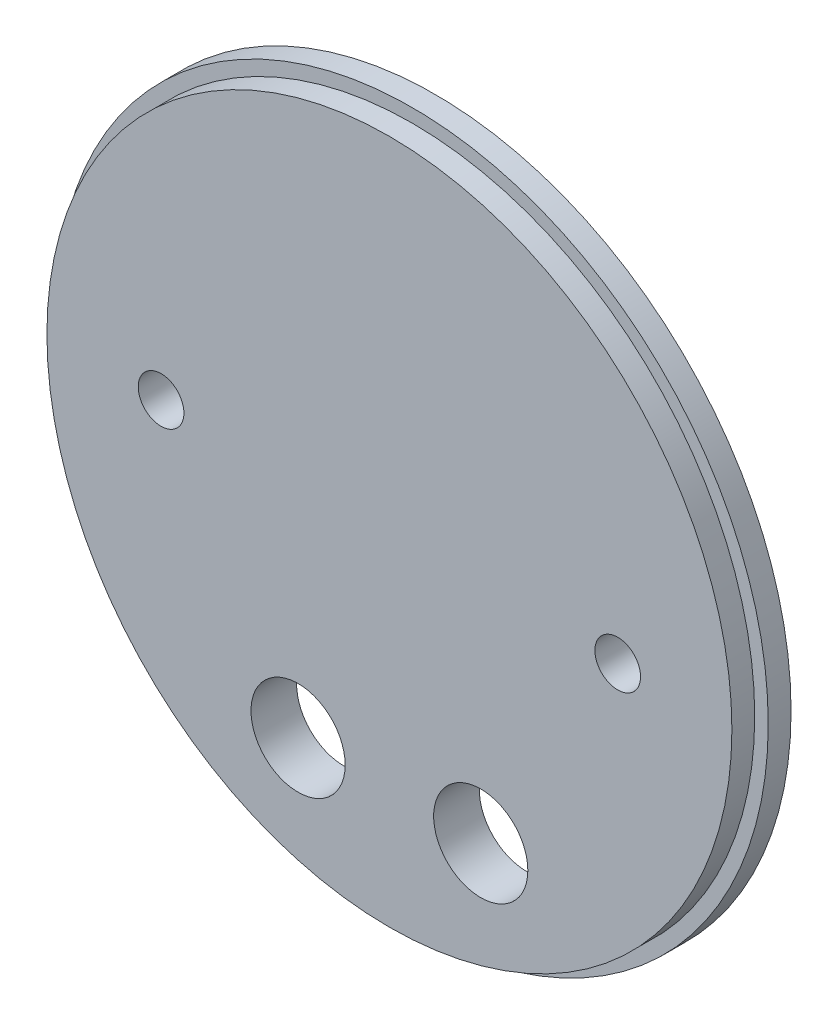
ISO-10303-21;
HEADER;
FILE_DESCRIPTION(('STEP AP214'),'2;1');
FILE_NAME('part.step','',(''),(''),'','','');
FILE_SCHEMA(('AUTOMOTIVE_DESIGN { 1 0 10303 214 1 1 1 1 }'));
ENDSEC;
DATA;
#1=APPLICATION_CONTEXT('core data for automotive mechanical design processes');
#2=APPLICATION_PROTOCOL_DEFINITION('international standard','automotive_design',2000,#1);
#3=PRODUCT_CONTEXT('',#1,'mechanical');
#4=PRODUCT('Part','Part','',(#3));
#5=PRODUCT_RELATED_PRODUCT_CATEGORY('part','',(#4));
#6=PRODUCT_DEFINITION_FORMATION('','',#4);
#7=PRODUCT_DEFINITION_CONTEXT('part definition',#1,'design');
#8=PRODUCT_DEFINITION('design','',#6,#7);
#9=PRODUCT_DEFINITION_SHAPE('','',#8);
#10=(LENGTH_UNIT() NAMED_UNIT(*) SI_UNIT(.MILLI.,.METRE.));
#11=(NAMED_UNIT(*) PLANE_ANGLE_UNIT() SI_UNIT($,.RADIAN.));
#12=(NAMED_UNIT(*) SI_UNIT($,.STERADIAN.) SOLID_ANGLE_UNIT());
#13=UNCERTAINTY_MEASURE_WITH_UNIT(LENGTH_MEASURE(1.E-05),#10,'distance_accuracy_value','');
#14=(GEOMETRIC_REPRESENTATION_CONTEXT(3) GLOBAL_UNCERTAINTY_ASSIGNED_CONTEXT((#13)) GLOBAL_UNIT_ASSIGNED_CONTEXT((#10,
#11,#12)) REPRESENTATION_CONTEXT('',''));
#15=CARTESIAN_POINT('',(0.,0.,0.));
#16=DIRECTION('',(0.,0.,1.));
#17=DIRECTION('',(1.,0.,0.));
#18=AXIS2_PLACEMENT_3D('',#15,#16,#17);
#19=CARTESIAN_POINT('',(0.,0.,3.175));
#20=DIRECTION('',(0.,0.,-1.));
#21=DIRECTION('',(-1.,0.,0.));
#22=AXIS2_PLACEMENT_3D('',#19,#20,#21);
#23=CYLINDRICAL_SURFACE('',#22,49.5046);
#24=CARTESIAN_POINT('',(0.,0.,3.175));
#25=DIRECTION('',(0.,0.,1.));
#26=DIRECTION('',(1.,0.,0.));
#27=AXIS2_PLACEMENT_3D('',#24,#25,#26);
#28=CIRCLE('',#27,49.5046);
#29=CARTESIAN_POINT('',(49.5046,0.,3.175));
#30=VERTEX_POINT('',#29);
#31=EDGE_CURVE('E39',#30,#30,#28,.T.);
#32=ORIENTED_EDGE('',*,*,#31,.F.);
#33=EDGE_LOOP('',(#32));
#34=FACE_BOUND('',#33,.T.);
#35=CARTESIAN_POINT('',(0.,0.,0.));
#36=DIRECTION('',(0.,0.,1.));
#37=DIRECTION('',(1.,0.,0.));
#38=AXIS2_PLACEMENT_3D('',#35,#36,#37);
#39=CIRCLE('',#38,49.5046);
#40=CARTESIAN_POINT('',(49.5046,0.,0.));
#41=VERTEX_POINT('',#40);
#42=EDGE_CURVE('E35',#41,#41,#39,.T.);
#43=ORIENTED_EDGE('',*,*,#42,.T.);
#44=EDGE_LOOP('',(#43));
#45=FACE_BOUND('',#44,.T.);
#46=ADVANCED_FACE('F32',(#34,#45),#23,.T.);
#47=CARTESIAN_POINT('',(0.,0.,3.175));
#48=DIRECTION('',(0.,0.,1.));
#49=DIRECTION('',(1.,0.,0.));
#50=AXIS2_PLACEMENT_3D('',#47,#48,#49);
#51=PLANE('',#50);
#52=CARTESIAN_POINT('',(0.,0.,3.175));
#53=DIRECTION('',(0.,0.,1.));
#54=DIRECTION('',(1.,0.,0.));
#55=AXIS2_PLACEMENT_3D('',#52,#53,#54);
#56=CIRCLE('',#55,47.625);
#57=CARTESIAN_POINT('',(47.625,0.,3.175));
#58=VERTEX_POINT('',#57);
#59=EDGE_CURVE('E10',#58,#58,#56,.T.);
#60=ORIENTED_EDGE('',*,*,#59,.F.);
#61=EDGE_LOOP('',(#60));
#62=FACE_BOUND('',#61,.T.);
#63=ORIENTED_EDGE('',*,*,#31,.T.);
#64=EDGE_LOOP('',(#63));
#65=FACE_BOUND('',#64,.T.);
#66=ADVANCED_FACE('F99',(#62,#65),#51,.T.);
#67=CARTESIAN_POINT('',(0.,0.,0.));
#68=DIRECTION('',(0.,0.,1.));
#69=DIRECTION('',(1.,0.,0.));
#70=AXIS2_PLACEMENT_3D('',#67,#68,#69);
#71=PLANE('',#70);
#72=CARTESIAN_POINT('',(31.75,0.,0.));
#73=DIRECTION('',(0.,0.,1.));
#74=DIRECTION('',(1.,0.,0.));
#75=AXIS2_PLACEMENT_3D('',#72,#73,#74);
#76=CIRCLE('',#75,3.175);
#77=CARTESIAN_POINT('',(34.925,0.,0.));
#78=VERTEX_POINT('',#77);
#79=EDGE_CURVE('E58',#78,#78,#76,.T.);
#80=ORIENTED_EDGE('',*,*,#79,.T.);
#81=EDGE_LOOP('',(#80));
#82=FACE_BOUND('',#81,.T.);
#83=CARTESIAN_POINT('',(-31.75,0.,0.));
#84=DIRECTION('',(0.,0.,1.));
#85=DIRECTION('',(1.,0.,0.));
#86=AXIS2_PLACEMENT_3D('',#83,#84,#85);
#87=CIRCLE('',#86,3.175);
#88=CARTESIAN_POINT('',(-28.575,0.,0.));
#89=VERTEX_POINT('',#88);
#90=EDGE_CURVE('E64',#89,#89,#87,.T.);
#91=ORIENTED_EDGE('',*,*,#90,.T.);
#92=EDGE_LOOP('',(#91));
#93=FACE_BOUND('',#92,.T.);
#94=CARTESIAN_POINT('',(12.7,-31.1667936271924,0.));
#95=DIRECTION('',(0.,0.,1.));
#96=DIRECTION('',(1.,0.,0.));
#97=AXIS2_PLACEMENT_3D('',#94,#95,#96);
#98=CIRCLE('',#97,6.5484375);
#99=CARTESIAN_POINT('',(19.2484375,-31.1667936271924,0.));
#100=VERTEX_POINT('',#99);
#101=EDGE_CURVE('E52',#100,#100,#98,.T.);
#102=ORIENTED_EDGE('',*,*,#101,.T.);
#103=EDGE_LOOP('',(#102));
#104=FACE_BOUND('',#103,.T.);
#105=CARTESIAN_POINT('',(-12.7,-31.1667936271924,0.));
#106=DIRECTION('',(0.,0.,1.));
#107=DIRECTION('',(1.,0.,0.));
#108=AXIS2_PLACEMENT_3D('',#105,#106,#107);
#109=CIRCLE('',#108,6.5484375);
#110=CARTESIAN_POINT('',(-6.1515625,-31.1667936271924,0.));
#111=VERTEX_POINT('',#110);
#112=EDGE_CURVE('E48',#111,#111,#109,.T.);
#113=ORIENTED_EDGE('',*,*,#112,.T.);
#114=EDGE_LOOP('',(#113));
#115=FACE_BOUND('',#114,.T.);
#116=ORIENTED_EDGE('',*,*,#42,.F.);
#117=EDGE_LOOP('',(#116));
#118=FACE_BOUND('',#117,.T.);
#119=ADVANCED_FACE('F73',(#82,#93,#104,#115,#118),#71,.F.);
#120=CARTESIAN_POINT('',(0.,0.,6.35));
#121=DIRECTION('',(0.,0.,-1.));
#122=DIRECTION('',(-1.,0.,0.));
#123=AXIS2_PLACEMENT_3D('',#120,#121,#122);
#124=CYLINDRICAL_SURFACE('',#123,47.625);
#125=CARTESIAN_POINT('',(0.,0.,6.35));
#126=DIRECTION('',(0.,0.,1.));
#127=DIRECTION('',(1.,0.,0.));
#128=AXIS2_PLACEMENT_3D('',#125,#126,#127);
#129=CIRCLE('',#128,47.625);
#130=CARTESIAN_POINT('',(47.625,0.,6.35));
#131=VERTEX_POINT('',#130);
#132=EDGE_CURVE('E45',#131,#131,#129,.T.);
#133=ORIENTED_EDGE('',*,*,#132,.F.);
#134=EDGE_LOOP('',(#133));
#135=FACE_BOUND('',#134,.T.);
#136=ORIENTED_EDGE('',*,*,#59,.T.);
#137=EDGE_LOOP('',(#136));
#138=FACE_BOUND('',#137,.T.);
#139=ADVANCED_FACE('F87',(#135,#138),#124,.T.);
#140=CARTESIAN_POINT('',(0.,0.,6.35));
#141=DIRECTION('',(0.,0.,1.));
#142=DIRECTION('',(1.,0.,0.));
#143=AXIS2_PLACEMENT_3D('',#140,#141,#142);
#144=PLANE('',#143);
#145=CARTESIAN_POINT('',(31.75,0.,6.35));
#146=DIRECTION('',(0.,0.,1.));
#147=DIRECTION('',(1.,0.,0.));
#148=AXIS2_PLACEMENT_3D('',#145,#146,#147);
#149=CIRCLE('',#148,3.175);
#150=CARTESIAN_POINT('',(34.925,0.,6.35));
#151=VERTEX_POINT('',#150);
#152=EDGE_CURVE('E55',#151,#151,#149,.T.);
#153=ORIENTED_EDGE('',*,*,#152,.F.);
#154=EDGE_LOOP('',(#153));
#155=FACE_BOUND('',#154,.T.);
#156=CARTESIAN_POINT('',(-31.75,0.,6.35));
#157=DIRECTION('',(0.,0.,1.));
#158=DIRECTION('',(1.,0.,0.));
#159=AXIS2_PLACEMENT_3D('',#156,#157,#158);
#160=CIRCLE('',#159,3.175);
#161=CARTESIAN_POINT('',(-28.575,0.,6.35));
#162=VERTEX_POINT('',#161);
#163=EDGE_CURVE('E61',#162,#162,#160,.T.);
#164=ORIENTED_EDGE('',*,*,#163,.F.);
#165=EDGE_LOOP('',(#164));
#166=FACE_BOUND('',#165,.T.);
#167=CARTESIAN_POINT('',(12.7,-31.1667936271924,6.35));
#168=DIRECTION('',(0.,0.,1.));
#169=DIRECTION('',(1.,0.,0.));
#170=AXIS2_PLACEMENT_3D('',#167,#168,#169);
#171=CIRCLE('',#170,6.5484375);
#172=CARTESIAN_POINT('',(19.2484375,-31.1667936271924,6.35));
#173=VERTEX_POINT('',#172);
#174=EDGE_CURVE('E67',#173,#173,#171,.T.);
#175=ORIENTED_EDGE('',*,*,#174,.F.);
#176=EDGE_LOOP('',(#175));
#177=FACE_BOUND('',#176,.T.);
#178=CARTESIAN_POINT('',(-12.7,-31.1667936271924,6.35));
#179=DIRECTION('',(0.,0.,1.));
#180=DIRECTION('',(1.,0.,0.));
#181=AXIS2_PLACEMENT_3D('',#178,#179,#180);
#182=CIRCLE('',#181,6.5484375);
#183=CARTESIAN_POINT('',(-6.1515625,-31.1667936271924,6.35));
#184=VERTEX_POINT('',#183);
#185=EDGE_CURVE('E49',#184,#184,#182,.T.);
#186=ORIENTED_EDGE('',*,*,#185,.F.);
#187=EDGE_LOOP('',(#186));
#188=FACE_BOUND('',#187,.T.);
#189=ORIENTED_EDGE('',*,*,#132,.T.);
#190=EDGE_LOOP('',(#189));
#191=FACE_BOUND('',#190,.T.);
#192=ADVANCED_FACE('F84',(#155,#166,#177,#188,#191),#144,.T.);
#193=CARTESIAN_POINT('',(-12.7,-31.1667936271924,0.));
#194=DIRECTION('',(0.,0.,1.));
#195=DIRECTION('',(1.,0.,0.));
#196=AXIS2_PLACEMENT_3D('',#193,#194,#195);
#197=CYLINDRICAL_SURFACE('',#196,6.5484375);
#198=ORIENTED_EDGE('',*,*,#112,.F.);
#199=EDGE_LOOP('',(#198));
#200=FACE_BOUND('',#199,.T.);
#201=ORIENTED_EDGE('',*,*,#185,.T.);
#202=EDGE_LOOP('',(#201));
#203=FACE_BOUND('',#202,.T.);
#204=ADVANCED_FACE('F80',(#200,#203),#197,.F.);
#205=CARTESIAN_POINT('',(12.7,-31.1667936271924,0.));
#206=DIRECTION('',(0.,0.,1.));
#207=DIRECTION('',(1.,0.,0.));
#208=AXIS2_PLACEMENT_3D('',#205,#206,#207);
#209=CYLINDRICAL_SURFACE('',#208,6.5484375);
#210=ORIENTED_EDGE('',*,*,#101,.F.);
#211=EDGE_LOOP('',(#210));
#212=FACE_BOUND('',#211,.T.);
#213=ORIENTED_EDGE('',*,*,#174,.T.);
#214=EDGE_LOOP('',(#213));
#215=FACE_BOUND('',#214,.T.);
#216=ADVANCED_FACE('F76',(#212,#215),#209,.F.);
#217=CARTESIAN_POINT('',(-31.75,0.,0.));
#218=DIRECTION('',(0.,0.,1.));
#219=DIRECTION('',(1.,0.,0.));
#220=AXIS2_PLACEMENT_3D('',#217,#218,#219);
#221=CYLINDRICAL_SURFACE('',#220,3.175);
#222=ORIENTED_EDGE('',*,*,#90,.F.);
#223=EDGE_LOOP('',(#222));
#224=FACE_BOUND('',#223,.T.);
#225=ORIENTED_EDGE('',*,*,#163,.T.);
#226=EDGE_LOOP('',(#225));
#227=FACE_BOUND('',#226,.T.);
#228=ADVANCED_FACE('F79',(#224,#227),#221,.F.);
#229=CARTESIAN_POINT('',(31.75,0.,0.));
#230=DIRECTION('',(0.,0.,1.));
#231=DIRECTION('',(1.,0.,0.));
#232=AXIS2_PLACEMENT_3D('',#229,#230,#231);
#233=CYLINDRICAL_SURFACE('',#232,3.175);
#234=ORIENTED_EDGE('',*,*,#79,.F.);
#235=EDGE_LOOP('',(#234));
#236=FACE_BOUND('',#235,.T.);
#237=ORIENTED_EDGE('',*,*,#152,.T.);
#238=EDGE_LOOP('',(#237));
#239=FACE_BOUND('',#238,.T.);
#240=ADVANCED_FACE('F152',(#236,#239),#233,.F.);
#241=CLOSED_SHELL('',(#46,#66,#119,#139,#192,#204,#216,#228,#240));
#242=MANIFOLD_SOLID_BREP('B2',#241);
#243=ADVANCED_BREP_SHAPE_REPRESENTATION('',(#18,#242),#14);
#244=SHAPE_DEFINITION_REPRESENTATION(#9,#243);
ENDSEC;
END-ISO-10303-21;
